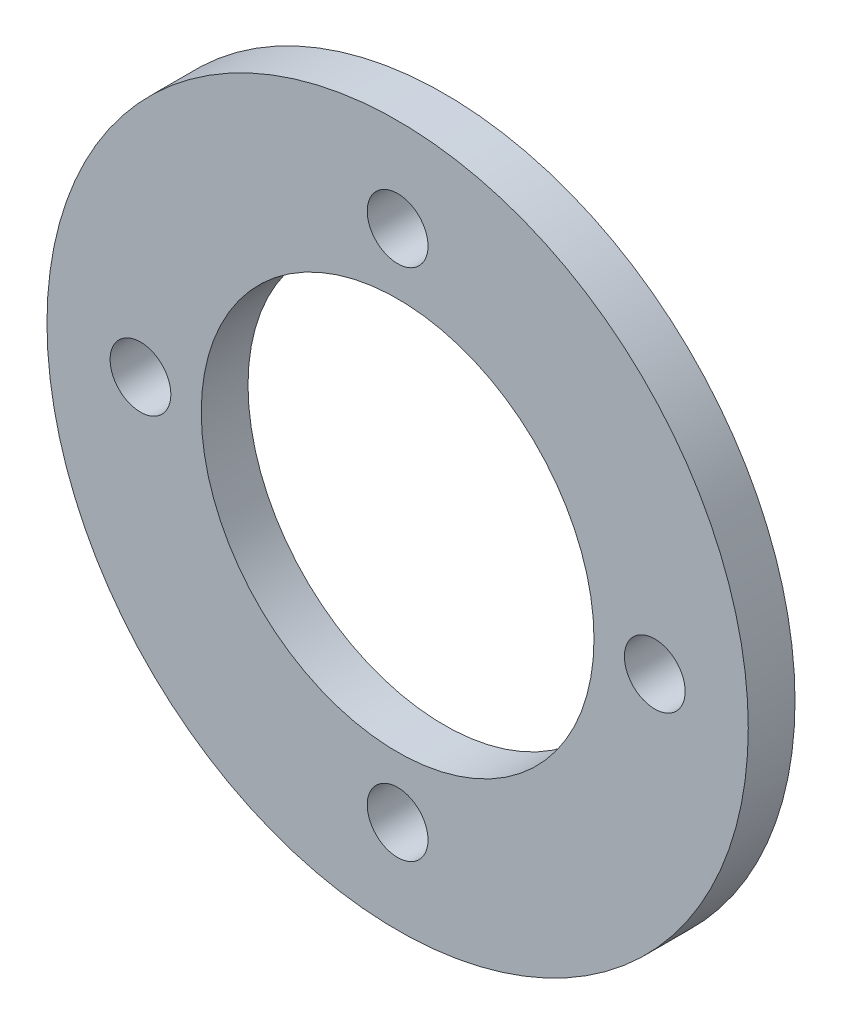
ISO-10303-21;
HEADER;
FILE_DESCRIPTION(('STEP AP214'),'2;1');
FILE_NAME('part.step','',(''),(''),'','','');
FILE_SCHEMA(('AUTOMOTIVE_DESIGN { 1 0 10303 214 1 1 1 1 }'));
ENDSEC;
DATA;
#1=APPLICATION_CONTEXT('core data for automotive mechanical design processes');
#2=APPLICATION_PROTOCOL_DEFINITION('international standard','automotive_design',2000,#1);
#3=PRODUCT_CONTEXT('',#1,'mechanical');
#4=PRODUCT('Part','Part','',(#3));
#5=PRODUCT_RELATED_PRODUCT_CATEGORY('part','',(#4));
#6=PRODUCT_DEFINITION_FORMATION('','',#4);
#7=PRODUCT_DEFINITION_CONTEXT('part definition',#1,'design');
#8=PRODUCT_DEFINITION('design','',#6,#7);
#9=PRODUCT_DEFINITION_SHAPE('','',#8);
#10=(LENGTH_UNIT() NAMED_UNIT(*) SI_UNIT(.MILLI.,.METRE.));
#11=(NAMED_UNIT(*) PLANE_ANGLE_UNIT() SI_UNIT($,.RADIAN.));
#12=(NAMED_UNIT(*) SI_UNIT($,.STERADIAN.) SOLID_ANGLE_UNIT());
#13=UNCERTAINTY_MEASURE_WITH_UNIT(LENGTH_MEASURE(1.E-05),#10,'distance_accuracy_value','');
#14=(GEOMETRIC_REPRESENTATION_CONTEXT(3) GLOBAL_UNCERTAINTY_ASSIGNED_CONTEXT((#13)) GLOBAL_UNIT_ASSIGNED_CONTEXT((#10,
#11,#12)) REPRESENTATION_CONTEXT('',''));
#15=CARTESIAN_POINT('',(0.,0.,0.));
#16=DIRECTION('',(0.,0.,1.));
#17=DIRECTION('',(1.,0.,0.));
#18=AXIS2_PLACEMENT_3D('',#15,#16,#17);
#19=CARTESIAN_POINT('',(0.,0.,-10.));
#20=DIRECTION('',(0.,0.,1.));
#21=DIRECTION('',(1.,0.,0.));
#22=AXIS2_PLACEMENT_3D('',#19,#20,#21);
#23=CYLINDRICAL_SURFACE('',#22,75.);
#24=CARTESIAN_POINT('',(0.,0.,-10.));
#25=DIRECTION('',(0.,0.,1.));
#26=DIRECTION('',(1.,0.,0.));
#27=AXIS2_PLACEMENT_3D('',#24,#25,#26);
#28=CIRCLE('',#27,75.);
#29=CARTESIAN_POINT('',(75.,0.,-10.));
#30=VERTEX_POINT('',#29);
#31=EDGE_CURVE('E10',#30,#30,#28,.T.);
#32=ORIENTED_EDGE('',*,*,#31,.T.);
#33=EDGE_LOOP('',(#32));
#34=FACE_BOUND('',#33,.T.);
#35=CARTESIAN_POINT('',(0.,0.,0.));
#36=DIRECTION('',(0.,0.,1.));
#37=DIRECTION('',(1.,0.,0.));
#38=AXIS2_PLACEMENT_3D('',#35,#36,#37);
#39=CIRCLE('',#38,75.);
#40=CARTESIAN_POINT('',(75.,0.,0.));
#41=VERTEX_POINT('',#40);
#42=EDGE_CURVE('E43',#41,#41,#39,.T.);
#43=ORIENTED_EDGE('',*,*,#42,.F.);
#44=EDGE_LOOP('',(#43));
#45=FACE_BOUND('',#44,.T.);
#46=ADVANCED_FACE('F39',(#34,#45),#23,.T.);
#47=CARTESIAN_POINT('',(0.,0.,-10.));
#48=DIRECTION('',(0.,0.,1.));
#49=DIRECTION('',(1.,0.,0.));
#50=AXIS2_PLACEMENT_3D('',#47,#48,#49);
#51=PLANE('',#50);
#52=CARTESIAN_POINT('',(-55.,0.,-10.));
#53=DIRECTION('',(0.,0.,1.));
#54=DIRECTION('',(1.,0.,0.));
#55=AXIS2_PLACEMENT_3D('',#52,#53,#54);
#56=CIRCLE('',#55,6.5);
#57=CARTESIAN_POINT('',(-48.5,0.,-10.));
#58=VERTEX_POINT('',#57);
#59=EDGE_CURVE('E84',#58,#58,#56,.T.);
#60=ORIENTED_EDGE('',*,*,#59,.T.);
#61=EDGE_LOOP('',(#60));
#62=FACE_BOUND('',#61,.T.);
#63=CARTESIAN_POINT('',(0.,-55.,-10.));
#64=DIRECTION('',(0.,0.,1.));
#65=DIRECTION('',(1.,0.,0.));
#66=AXIS2_PLACEMENT_3D('',#63,#64,#65);
#67=CIRCLE('',#66,6.5);
#68=CARTESIAN_POINT('',(6.5,-55.,-10.));
#69=VERTEX_POINT('',#68);
#70=EDGE_CURVE('E76',#69,#69,#67,.T.);
#71=ORIENTED_EDGE('',*,*,#70,.T.);
#72=EDGE_LOOP('',(#71));
#73=FACE_BOUND('',#72,.T.);
#74=CARTESIAN_POINT('',(55.,0.,-10.));
#75=DIRECTION('',(0.,0.,1.));
#76=DIRECTION('',(1.,0.,0.));
#77=AXIS2_PLACEMENT_3D('',#74,#75,#76);
#78=CIRCLE('',#77,6.5);
#79=CARTESIAN_POINT('',(61.5,0.,-10.));
#80=VERTEX_POINT('',#79);
#81=EDGE_CURVE('E68',#80,#80,#78,.T.);
#82=ORIENTED_EDGE('',*,*,#81,.T.);
#83=EDGE_LOOP('',(#82));
#84=FACE_BOUND('',#83,.T.);
#85=CARTESIAN_POINT('',(0.,55.,-10.));
#86=DIRECTION('',(0.,0.,1.));
#87=DIRECTION('',(1.,0.,0.));
#88=AXIS2_PLACEMENT_3D('',#85,#86,#87);
#89=CIRCLE('',#88,6.5);
#90=CARTESIAN_POINT('',(6.5,55.,-10.));
#91=VERTEX_POINT('',#90);
#92=EDGE_CURVE('E61',#91,#91,#89,.T.);
#93=ORIENTED_EDGE('',*,*,#92,.T.);
#94=EDGE_LOOP('',(#93));
#95=FACE_BOUND('',#94,.T.);
#96=CARTESIAN_POINT('',(0.,0.,-10.));
#97=DIRECTION('',(0.,0.,1.));
#98=DIRECTION('',(1.,0.,0.));
#99=AXIS2_PLACEMENT_3D('',#96,#97,#98);
#100=CIRCLE('',#99,42.);
#101=CARTESIAN_POINT('',(42.,0.,-10.));
#102=VERTEX_POINT('',#101);
#103=EDGE_CURVE('E55',#102,#102,#100,.T.);
#104=ORIENTED_EDGE('',*,*,#103,.T.);
#105=EDGE_LOOP('',(#104));
#106=FACE_BOUND('',#105,.T.);
#107=ORIENTED_EDGE('',*,*,#31,.F.);
#108=EDGE_LOOP('',(#107));
#109=FACE_BOUND('',#108,.T.);
#110=ADVANCED_FACE('F96',(#62,#73,#84,#95,#106,#109),#51,.F.);
#111=CARTESIAN_POINT('',(0.,0.,0.));
#112=DIRECTION('',(0.,0.,1.));
#113=DIRECTION('',(1.,0.,0.));
#114=AXIS2_PLACEMENT_3D('',#111,#112,#113);
#115=PLANE('',#114);
#116=CARTESIAN_POINT('',(-55.,0.,0.));
#117=DIRECTION('',(0.,0.,1.));
#118=DIRECTION('',(1.,0.,0.));
#119=AXIS2_PLACEMENT_3D('',#116,#117,#118);
#120=CIRCLE('',#119,6.5);
#121=CARTESIAN_POINT('',(-48.5,0.,0.));
#122=VERTEX_POINT('',#121);
#123=EDGE_CURVE('E88',#122,#122,#120,.T.);
#124=ORIENTED_EDGE('',*,*,#123,.F.);
#125=EDGE_LOOP('',(#124));
#126=FACE_BOUND('',#125,.T.);
#127=CARTESIAN_POINT('',(0.,-55.,0.));
#128=DIRECTION('',(0.,0.,1.));
#129=DIRECTION('',(1.,0.,0.));
#130=AXIS2_PLACEMENT_3D('',#127,#128,#129);
#131=CIRCLE('',#130,6.5);
#132=CARTESIAN_POINT('',(6.5,-55.,0.));
#133=VERTEX_POINT('',#132);
#134=EDGE_CURVE('E80',#133,#133,#131,.T.);
#135=ORIENTED_EDGE('',*,*,#134,.F.);
#136=EDGE_LOOP('',(#135));
#137=FACE_BOUND('',#136,.T.);
#138=CARTESIAN_POINT('',(55.,0.,0.));
#139=DIRECTION('',(0.,0.,1.));
#140=DIRECTION('',(1.,0.,0.));
#141=AXIS2_PLACEMENT_3D('',#138,#139,#140);
#142=CIRCLE('',#141,6.5);
#143=CARTESIAN_POINT('',(61.5,0.,0.));
#144=VERTEX_POINT('',#143);
#145=EDGE_CURVE('E72',#144,#144,#142,.T.);
#146=ORIENTED_EDGE('',*,*,#145,.F.);
#147=EDGE_LOOP('',(#146));
#148=FACE_BOUND('',#147,.T.);
#149=CARTESIAN_POINT('',(0.,55.,0.));
#150=DIRECTION('',(0.,0.,1.));
#151=DIRECTION('',(1.,0.,0.));
#152=AXIS2_PLACEMENT_3D('',#149,#150,#151);
#153=CIRCLE('',#152,6.5);
#154=CARTESIAN_POINT('',(6.5,55.,0.));
#155=VERTEX_POINT('',#154);
#156=EDGE_CURVE('E64',#155,#155,#153,.T.);
#157=ORIENTED_EDGE('',*,*,#156,.F.);
#158=EDGE_LOOP('',(#157));
#159=FACE_BOUND('',#158,.T.);
#160=CARTESIAN_POINT('',(0.,0.,0.));
#161=DIRECTION('',(0.,0.,1.));
#162=DIRECTION('',(1.,0.,0.));
#163=AXIS2_PLACEMENT_3D('',#160,#161,#162);
#164=CIRCLE('',#163,42.);
#165=CARTESIAN_POINT('',(42.,0.,0.));
#166=VERTEX_POINT('',#165);
#167=EDGE_CURVE('E57',#166,#166,#164,.T.);
#168=ORIENTED_EDGE('',*,*,#167,.F.);
#169=EDGE_LOOP('',(#168));
#170=FACE_BOUND('',#169,.T.);
#171=ORIENTED_EDGE('',*,*,#42,.T.);
#172=EDGE_LOOP('',(#171));
#173=FACE_BOUND('',#172,.T.);
#174=ADVANCED_FACE('F41',(#126,#137,#148,#159,#170,#173),#115,.T.);
#175=CARTESIAN_POINT('',(0.,0.,-10.));
#176=DIRECTION('',(0.,0.,1.));
#177=DIRECTION('',(1.,0.,0.));
#178=AXIS2_PLACEMENT_3D('',#175,#176,#177);
#179=CYLINDRICAL_SURFACE('',#178,42.);
#180=ORIENTED_EDGE('',*,*,#103,.F.);
#181=EDGE_LOOP('',(#180));
#182=FACE_BOUND('',#181,.T.);
#183=ORIENTED_EDGE('',*,*,#167,.T.);
#184=EDGE_LOOP('',(#183));
#185=FACE_BOUND('',#184,.T.);
#186=ADVANCED_FACE('F108',(#182,#185),#179,.F.);
#187=CARTESIAN_POINT('',(0.,55.,-10.));
#188=DIRECTION('',(0.,0.,1.));
#189=DIRECTION('',(1.,0.,0.));
#190=AXIS2_PLACEMENT_3D('',#187,#188,#189);
#191=CYLINDRICAL_SURFACE('',#190,6.5);
#192=ORIENTED_EDGE('',*,*,#92,.F.);
#193=EDGE_LOOP('',(#192));
#194=FACE_BOUND('',#193,.T.);
#195=ORIENTED_EDGE('',*,*,#156,.T.);
#196=EDGE_LOOP('',(#195));
#197=FACE_BOUND('',#196,.T.);
#198=ADVANCED_FACE('F127',(#194,#197),#191,.F.);
#199=CARTESIAN_POINT('',(55.,0.,-10.));
#200=DIRECTION('',(0.,0.,1.));
#201=DIRECTION('',(1.,0.,0.));
#202=AXIS2_PLACEMENT_3D('',#199,#200,#201);
#203=CYLINDRICAL_SURFACE('',#202,6.5);
#204=ORIENTED_EDGE('',*,*,#81,.F.);
#205=EDGE_LOOP('',(#204));
#206=FACE_BOUND('',#205,.T.);
#207=ORIENTED_EDGE('',*,*,#145,.T.);
#208=EDGE_LOOP('',(#207));
#209=FACE_BOUND('',#208,.T.);
#210=ADVANCED_FACE('F131',(#206,#209),#203,.F.);
#211=CARTESIAN_POINT('',(0.,-55.,-10.));
#212=DIRECTION('',(0.,0.,1.));
#213=DIRECTION('',(1.,0.,0.));
#214=AXIS2_PLACEMENT_3D('',#211,#212,#213);
#215=CYLINDRICAL_SURFACE('',#214,6.5);
#216=ORIENTED_EDGE('',*,*,#70,.F.);
#217=EDGE_LOOP('',(#216));
#218=FACE_BOUND('',#217,.T.);
#219=ORIENTED_EDGE('',*,*,#134,.T.);
#220=EDGE_LOOP('',(#219));
#221=FACE_BOUND('',#220,.T.);
#222=ADVANCED_FACE('F102',(#218,#221),#215,.F.);
#223=CARTESIAN_POINT('',(-55.,0.,-10.));
#224=DIRECTION('',(0.,0.,1.));
#225=DIRECTION('',(1.,0.,0.));
#226=AXIS2_PLACEMENT_3D('',#223,#224,#225);
#227=CYLINDRICAL_SURFACE('',#226,6.5);
#228=ORIENTED_EDGE('',*,*,#59,.F.);
#229=EDGE_LOOP('',(#228));
#230=FACE_BOUND('',#229,.T.);
#231=ORIENTED_EDGE('',*,*,#123,.T.);
#232=EDGE_LOOP('',(#231));
#233=FACE_BOUND('',#232,.T.);
#234=ADVANCED_FACE('F99',(#230,#233),#227,.F.);
#235=CLOSED_SHELL('',(#46,#110,#174,#186,#198,#210,#222,#234));
#236=MANIFOLD_SOLID_BREP('B2',#235);
#237=ADVANCED_BREP_SHAPE_REPRESENTATION('',(#18,#236),#14);
#238=SHAPE_DEFINITION_REPRESENTATION(#9,#237);
ENDSEC;
END-ISO-10303-21;
